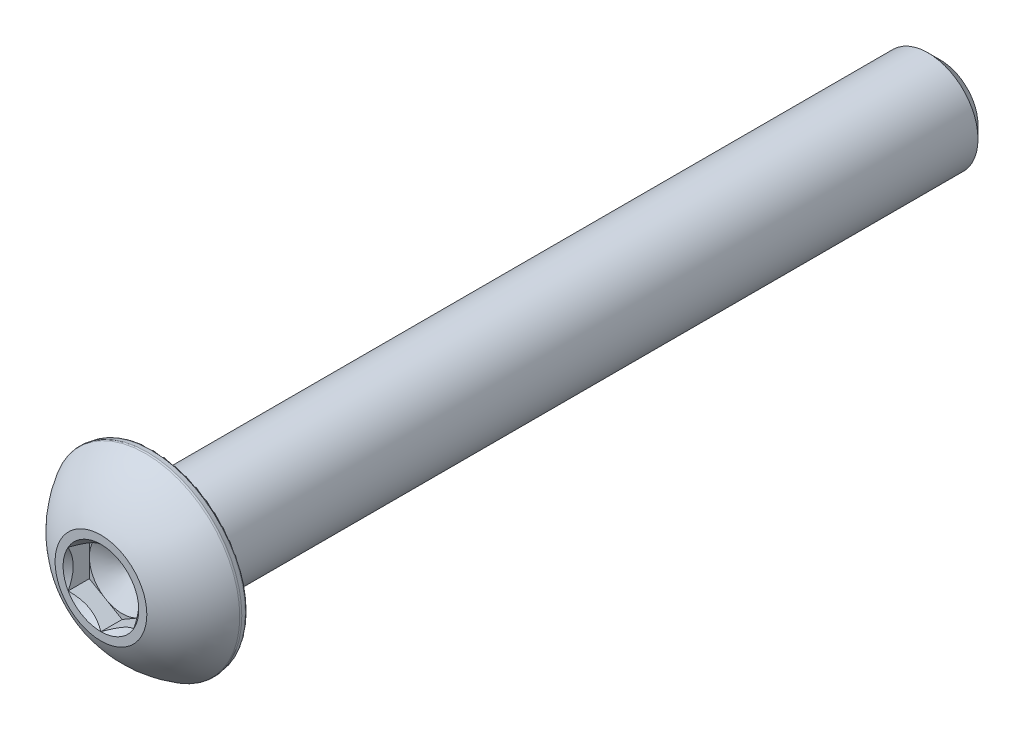
ISO-10303-21;
HEADER;
FILE_DESCRIPTION(('STEP AP214'),'2;1');
FILE_NAME('part.step','',(''),(''),'','','');
FILE_SCHEMA(('AUTOMOTIVE_DESIGN { 1 0 10303 214 1 1 1 1 }'));
ENDSEC;
DATA;
#1=APPLICATION_CONTEXT('core data for automotive mechanical design processes');
#2=APPLICATION_PROTOCOL_DEFINITION('international standard','automotive_design',2000,#1);
#3=PRODUCT_CONTEXT('',#1,'mechanical');
#4=PRODUCT('Part','Part','',(#3));
#5=PRODUCT_RELATED_PRODUCT_CATEGORY('part','',(#4));
#6=PRODUCT_DEFINITION_FORMATION('','',#4);
#7=PRODUCT_DEFINITION_CONTEXT('part definition',#1,'design');
#8=PRODUCT_DEFINITION('design','',#6,#7);
#9=PRODUCT_DEFINITION_SHAPE('','',#8);
#10=(LENGTH_UNIT() NAMED_UNIT(*) SI_UNIT(.MILLI.,.METRE.));
#11=(NAMED_UNIT(*) PLANE_ANGLE_UNIT() SI_UNIT($,.RADIAN.));
#12=(NAMED_UNIT(*) SI_UNIT($,.STERADIAN.) SOLID_ANGLE_UNIT());
#13=UNCERTAINTY_MEASURE_WITH_UNIT(LENGTH_MEASURE(1.E-05),#10,'distance_accuracy_value','');
#14=(GEOMETRIC_REPRESENTATION_CONTEXT(3) GLOBAL_UNCERTAINTY_ASSIGNED_CONTEXT((#13)) GLOBAL_UNIT_ASSIGNED_CONTEXT((#10,
#11,#12)) REPRESENTATION_CONTEXT('',''));
#15=CARTESIAN_POINT('',(0.,0.,0.));
#16=DIRECTION('',(0.,0.,1.));
#17=DIRECTION('',(1.,0.,0.));
#18=AXIS2_PLACEMENT_3D('',#15,#16,#17);
#19=CARTESIAN_POINT('',(0.,1.5875,20.3327));
#20=DIRECTION('',(0.,0.,-1.));
#21=DIRECTION('',(-1.,0.,0.));
#22=AXIS2_PLACEMENT_3D('',#19,#20,#21);
#23=PLANE('',#22);
#24=CARTESIAN_POINT('',(0.,0.,20.3327));
#25=DIRECTION('',(0.,0.,1.));
#26=DIRECTION('',(1.,0.,0.));
#27=AXIS2_PLACEMENT_3D('',#24,#25,#26);
#28=CIRCLE('',#27,2.2225);
#29=CARTESIAN_POINT('',(2.2225,0.,20.3327));
#30=VERTEX_POINT('',#29);
#31=EDGE_CURVE('E169',#30,#30,#28,.T.);
#32=ORIENTED_EDGE('',*,*,#31,.T.);
#33=EDGE_LOOP('',(#32));
#34=FACE_BOUND('',#33,.T.);
#35=CARTESIAN_POINT('',(0.,0.,20.3327));
#36=DIRECTION('',(0.,0.,1.));
#37=DIRECTION('',(1.,0.,0.));
#38=AXIS2_PLACEMENT_3D('',#35,#36,#37);
#39=CIRCLE('',#38,1.83308710467706);
#40=CARTESIAN_POINT('',(0.,1.83308710467706,20.3327));
#41=VERTEX_POINT('',#40);
#42=CARTESIAN_POINT('',(-1.5875,0.916543552338526,20.3327));
#43=VERTEX_POINT('',#42);
#44=EDGE_CURVE('E123',#41,#43,#39,.T.);
#45=ORIENTED_EDGE('',*,*,#44,.F.);
#46=CARTESIAN_POINT('',(0.,0.,20.3327));
#47=DIRECTION('',(0.,0.,1.));
#48=DIRECTION('',(1.,0.,0.));
#49=AXIS2_PLACEMENT_3D('',#46,#47,#48);
#50=CIRCLE('',#49,1.83308710467706);
#51=CARTESIAN_POINT('',(1.5875,0.916543552338528,20.3327));
#52=VERTEX_POINT('',#51);
#53=EDGE_CURVE('E108',#52,#41,#50,.T.);
#54=ORIENTED_EDGE('',*,*,#53,.F.);
#55=CARTESIAN_POINT('',(0.,0.,20.3327));
#56=DIRECTION('',(0.,0.,1.));
#57=DIRECTION('',(1.,0.,0.));
#58=AXIS2_PLACEMENT_3D('',#55,#56,#57);
#59=CIRCLE('',#58,1.83308710467706);
#60=CARTESIAN_POINT('',(1.5875,-0.916543552338527,20.3327));
#61=VERTEX_POINT('',#60);
#62=EDGE_CURVE('E119',#61,#52,#59,.T.);
#63=ORIENTED_EDGE('',*,*,#62,.F.);
#64=CARTESIAN_POINT('',(0.,0.,20.3327));
#65=DIRECTION('',(0.,0.,1.));
#66=DIRECTION('',(1.,0.,0.));
#67=AXIS2_PLACEMENT_3D('',#64,#65,#66);
#68=CIRCLE('',#67,1.83308710467706);
#69=CARTESIAN_POINT('',(0.,-1.83308710467706,20.3327));
#70=VERTEX_POINT('',#69);
#71=EDGE_CURVE('E140',#70,#61,#68,.T.);
#72=ORIENTED_EDGE('',*,*,#71,.F.);
#73=CARTESIAN_POINT('',(0.,0.,20.3327));
#74=DIRECTION('',(0.,0.,1.));
#75=DIRECTION('',(1.,0.,0.));
#76=AXIS2_PLACEMENT_3D('',#73,#74,#75);
#77=CIRCLE('',#76,1.83308710467706);
#78=CARTESIAN_POINT('',(-1.5875,-0.916543552338531,20.3327));
#79=VERTEX_POINT('',#78);
#80=EDGE_CURVE('E542',#79,#70,#77,.T.);
#81=ORIENTED_EDGE('',*,*,#80,.F.);
#82=CARTESIAN_POINT('',(0.,0.,20.3327));
#83=DIRECTION('',(0.,0.,1.));
#84=DIRECTION('',(1.,0.,0.));
#85=AXIS2_PLACEMENT_3D('',#82,#83,#84);
#86=CIRCLE('',#85,1.83308710467706);
#87=EDGE_CURVE('E285',#43,#79,#86,.T.);
#88=ORIENTED_EDGE('',*,*,#87,.F.);
#89=EDGE_LOOP('',(#45,#54,#63,#72,#81,#88));
#90=FACE_BOUND('',#89,.T.);
#91=ADVANCED_FACE('F35',(#34,#90),#23,.F.);
#92=CARTESIAN_POINT('',(0.,0.,-20.3327));
#93=DIRECTION('',(0.,0.,1.));
#94=DIRECTION('',(1.,0.,0.));
#95=AXIS2_PLACEMENT_3D('',#92,#93,#94);
#96=CONICAL_SURFACE('',#95,1.8176875,0.785398163397447);
#97=CARTESIAN_POINT('',(0.,0.,-19.7373875));
#98=DIRECTION('',(0.,0.,1.));
#99=DIRECTION('',(1.,0.,0.));
#100=AXIS2_PLACEMENT_3D('',#97,#98,#99);
#101=CIRCLE('',#100,2.413);
#102=CARTESIAN_POINT('',(2.413,0.,-19.7373875));
#103=VERTEX_POINT('',#102);
#104=EDGE_CURVE('E176',#103,#103,#101,.T.);
#105=ORIENTED_EDGE('',*,*,#104,.F.);
#106=EDGE_LOOP('',(#105));
#107=FACE_BOUND('',#106,.T.);
#108=CARTESIAN_POINT('',(0.,0.,-20.3327));
#109=DIRECTION('',(0.,0.,1.));
#110=DIRECTION('',(1.,0.,0.));
#111=AXIS2_PLACEMENT_3D('',#108,#109,#110);
#112=CIRCLE('',#111,1.8176875);
#113=CARTESIAN_POINT('',(1.8176875,0.,-20.3327));
#114=VERTEX_POINT('',#113);
#115=EDGE_CURVE('E162',#114,#114,#112,.T.);
#116=ORIENTED_EDGE('',*,*,#115,.T.);
#117=EDGE_LOOP('',(#116));
#118=FACE_BOUND('',#117,.T.);
#119=ADVANCED_FACE('F213',(#107,#118),#96,.T.);
#120=CARTESIAN_POINT('',(0.,0.,20.3327));
#121=DIRECTION('',(0.,0.,1.));
#122=DIRECTION('',(1.,0.,0.));
#123=AXIS2_PLACEMENT_3D('',#120,#121,#122);
#124=CYLINDRICAL_SURFACE('',#123,2.413);
#125=CARTESIAN_POINT('',(0.,0.,17.7673));
#126=DIRECTION('',(0.,0.,1.));
#127=DIRECTION('',(1.,0.,0.));
#128=AXIS2_PLACEMENT_3D('',#125,#126,#127);
#129=CIRCLE('',#128,2.413);
#130=CARTESIAN_POINT('',(2.413,0.,17.7673));
#131=VERTEX_POINT('',#130);
#132=EDGE_CURVE('E173',#131,#131,#129,.T.);
#133=ORIENTED_EDGE('',*,*,#132,.F.);
#134=EDGE_LOOP('',(#133));
#135=FACE_BOUND('',#134,.T.);
#136=ORIENTED_EDGE('',*,*,#104,.T.);
#137=EDGE_LOOP('',(#136));
#138=FACE_BOUND('',#137,.T.);
#139=ADVANCED_FACE('F218',(#135,#138),#124,.T.);
#140=CARTESIAN_POINT('',(0.,4.5207184955715,17.7673));
#141=DIRECTION('',(0.,0.,1.));
#142=DIRECTION('',(1.,0.,0.));
#143=AXIS2_PLACEMENT_3D('',#140,#141,#142);
#144=PLANE('',#143);
#145=CARTESIAN_POINT('',(0.,0.,17.7673));
#146=DIRECTION('',(0.,0.,1.));
#147=DIRECTION('',(1.,0.,0.));
#148=AXIS2_PLACEMENT_3D('',#145,#146,#147);
#149=CIRCLE('',#148,4.41308718588039);
#150=CARTESIAN_POINT('',(4.41308718588039,0.,17.7673));
#151=VERTEX_POINT('',#150);
#152=EDGE_CURVE('E43',#151,#151,#149,.F.);
#153=ORIENTED_EDGE('',*,*,#152,.T.);
#154=EDGE_LOOP('',(#153));
#155=FACE_BOUND('',#154,.T.);
#156=ORIENTED_EDGE('',*,*,#132,.T.);
#157=EDGE_LOOP('',(#156));
#158=FACE_BOUND('',#157,.T.);
#159=ADVANCED_FACE('F187',(#155,#158),#144,.F.);
#160=CARTESIAN_POINT('',(0.,0.,17.7673));
#161=DIRECTION('',(0.,0.,1.));
#162=DIRECTION('',(1.,0.,0.));
#163=AXIS2_PLACEMENT_3D('',#160,#161,#162);
#164=CONICAL_SURFACE('',#163,4.5207184955715,0.174532925199425);
#165=CARTESIAN_POINT('',(0.,0.,17.8732961482507));
#166=DIRECTION('',(0.,0.,-1.));
#167=DIRECTION('',(-1.,0.,0.));
#168=AXIS2_PLACEMENT_3D('',#165,#166,#167);
#169=CIRCLE('',#168,4.53940847635927);
#170=CARTESIAN_POINT('',(-4.53940847635927,0.,17.8732961482507));
#171=VERTEX_POINT('',#170);
#172=EDGE_CURVE('E182',#171,#171,#169,.F.);
#173=ORIENTED_EDGE('',*,*,#172,.T.);
#174=EDGE_LOOP('',(#173));
#175=FACE_BOUND('',#174,.T.);
#176=CARTESIAN_POINT('',(0.,0.,18.0850202312843));
#177=DIRECTION('',(0.,0.,-1.));
#178=DIRECTION('',(-1.,0.,0.));
#179=AXIS2_PLACEMENT_3D('',#176,#177,#178);
#180=CIRCLE('',#179,4.57674114466386);
#181=CARTESIAN_POINT('',(-4.57674114466386,0.,18.0850202312843));
#182=VERTEX_POINT('',#181);
#183=EDGE_CURVE('E179',#182,#182,#180,.T.);
#184=ORIENTED_EDGE('',*,*,#183,.T.);
#185=EDGE_LOOP('',(#184));
#186=FACE_BOUND('',#185,.T.);
#187=ADVANCED_FACE('F195',(#175,#186),#164,.T.);
#188=CARTESIAN_POINT('',(0.,0.,15.5811096257943));
#189=DIRECTION('',(0.,0.,1.));
#190=DIRECTION('',(0.,1.,0.));
#191=AXIS2_PLACEMENT_3D('',#188,#189,#190);
#192=SPHERICAL_SURFACE('',#191,5.24567606074225);
#193=CARTESIAN_POINT('',(0.,0.,18.1706139909096));
#194=DIRECTION('',(0.,0.,-1.));
#195=DIRECTION('',(-1.,0.,0.));
#196=AXIS2_PLACEMENT_3D('',#193,#194,#195);
#197=CIRCLE('',#196,4.56197155594959);
#198=CARTESIAN_POINT('',(-4.56197155594959,0.,18.1706139909096));
#199=VERTEX_POINT('',#198);
#200=EDGE_CURVE('E11',#199,#199,#197,.F.);
#201=ORIENTED_EDGE('',*,*,#200,.T.);
#202=EDGE_LOOP('',(#201));
#203=FACE_BOUND('',#202,.T.);
#204=ORIENTED_EDGE('',*,*,#31,.F.);
#205=EDGE_LOOP('',(#204));
#206=FACE_BOUND('',#205,.T.);
#207=ADVANCED_FACE('F198',(#203,#206),#192,.T.);
#208=CARTESIAN_POINT('',(0.,1.8176875,-20.3327));
#209=DIRECTION('',(0.,0.,1.));
#210=DIRECTION('',(1.,0.,0.));
#211=AXIS2_PLACEMENT_3D('',#208,#209,#210);
#212=PLANE('',#211);
#213=ORIENTED_EDGE('',*,*,#115,.F.);
#214=EDGE_LOOP('',(#213));
#215=FACE_BOUND('',#214,.T.);
#216=ADVANCED_FACE('F208',(#215),#212,.F.);
#217=CARTESIAN_POINT('',(1.5875,0.91654355233853,20.3327));
#218=DIRECTION('',(-0.499999999999999,-0.866025403784439,0.));
#219=DIRECTION('',(0.866025403784439,-0.499999999999999,0.));
#220=AXIS2_PLACEMENT_3D('',#217,#218,#219);
#221=PLANE('',#220);
#222=CARTESIAN_POINT('',(1.5877,0.916428082284693,20.3328154809637));
#223=CARTESIAN_POINT('',(1.53312479190086,0.947937093371809,20.3013308083706));
#224=CARTESIAN_POINT('',(1.47763696320971,0.979973006203394,20.2716950460135));
#225=CARTESIAN_POINT('',(1.36449087915364,1.04529792829092,20.2174322600208));
#226=CARTESIAN_POINT('',(1.30682185887062,1.07859315267522,20.1928354351332));
#227=CARTESIAN_POINT('',(1.1905349781269,1.14573141457583,20.1507003642726));
#228=CARTESIAN_POINT('',(1.13194674474407,1.17955734689075,20.1330561927298));
#229=CARTESIAN_POINT('',(1.01348022674557,1.24795402294714,20.105871470085));
#230=CARTESIAN_POINT('',(0.953605562983893,1.28252267618759,20.0963106206951));
#231=CARTESIAN_POINT('',(0.850418771876555,1.34209759781022,20.087684413104));
#232=CARTESIAN_POINT('',(0.807240015952285,1.36702686416637,20.0864071928096));
#233=CARTESIAN_POINT('',(0.720953038535396,1.41684467380557,20.0885570558147));
#234=CARTESIAN_POINT('',(0.677844847078609,1.44173319974742,20.0919857885493));
#235=CARTESIAN_POINT('',(0.592046335002028,1.49126899379091,20.1033509944333));
#236=CARTESIAN_POINT('',(0.549356408925404,1.51591603410293,20.1112913718016));
#237=CARTESIAN_POINT('',(0.464693063478356,1.56479643938728,20.1312484144511));
#238=CARTESIAN_POINT('',(0.422719959755072,1.58902962212064,20.1432668292087));
#239=CARTESIAN_POINT('',(0.315211458113564,1.65109968448354,20.1789468972472));
#240=CARTESIAN_POINT('',(0.250342771708898,1.68855163804125,20.2052985723031));
#241=CARTESIAN_POINT('',(0.154961599380923,1.74361998356043,20.2497835368517));
#242=CARTESIAN_POINT('',(0.123530699536155,1.76176662204668,20.2654128578011));
#243=CARTESIAN_POINT('',(0.0612469855696354,1.79772614107138,20.2980984878611));
#244=CARTESIAN_POINT('',(0.0303939039605747,1.8155391760437,20.315154115657));
#245=CARTESIAN_POINT('',(-0.000200000000001664,1.8332025747309,20.3328154809637));
#246=B_SPLINE_CURVE_WITH_KNOTS('',3,(#222,#223,#224,#225,#226,#227,#228,#229,#230,#231,#232,
#233,#234,#235,#236,#237,#238,#239,#240,#241,#242,#243,#244,#245),.UNSPECIFIED.,.F.,.F.,(4,2,2,
2,2,2,2,2,2,2,2,4),(0.,0.211482650810817,0.424197870807277,0.633533884524818,0.842342653263352,
0.991755553727145,1.14122083674205,1.29081565918878,1.44047473906438,1.6781878086972,
1.79671410024894,1.91518409436631),.UNSPECIFIED.);
#247=EDGE_CURVE('E105',#52,#41,#246,.T.);
#248=ORIENTED_EDGE('',*,*,#247,.T.);
#249=DIRECTION('',(0.,0.,-1.));
#250=VECTOR('',#249,1.);
#251=CARTESIAN_POINT('',(0.,1.83308710467706,20.3327));
#252=LINE('',#251,#250);
#253=CARTESIAN_POINT('',(0.,1.83308710467706,19.30654));
#254=VERTEX_POINT('',#253);
#255=EDGE_CURVE('E160',#41,#254,#252,.T.);
#256=ORIENTED_EDGE('',*,*,#255,.T.);
#257=DIRECTION('',(-0.866025403784439,0.499999999999999,0.));
#258=VECTOR('',#257,1.);
#259=CARTESIAN_POINT('',(1.5875,0.91654355233853,19.30654));
#260=LINE('',#259,#258);
#261=CARTESIAN_POINT('',(0.793749999999999,1.3748153285078,19.30654));
#262=VERTEX_POINT('',#261);
#263=EDGE_CURVE('E288',#262,#254,#260,.T.);
#264=ORIENTED_EDGE('',*,*,#263,.F.);
#265=CARTESIAN_POINT('',(1.5875,0.91654355233853,19.30654));
#266=VERTEX_POINT('',#265);
#267=EDGE_CURVE('E50',#266,#262,#260,.T.);
#268=ORIENTED_EDGE('',*,*,#267,.F.);
#269=DIRECTION('',(0.,0.,-1.));
#270=VECTOR('',#269,1.);
#271=CARTESIAN_POINT('',(1.5875,0.91654355233853,20.3327));
#272=LINE('',#271,#270);
#273=EDGE_CURVE('E136',#52,#266,#272,.T.);
#274=ORIENTED_EDGE('',*,*,#273,.F.);
#275=EDGE_LOOP('',(#248,#256,#264,#268,#274));
#276=FACE_BOUND('',#275,.T.);
#277=ADVANCED_FACE('F142',(#276),#221,.T.);
#278=CARTESIAN_POINT('',(0.,1.83308710467706,20.3327));
#279=DIRECTION('',(0.5,-0.866025403784438,0.));
#280=DIRECTION('',(0.866025403784438,0.5,0.));
#281=AXIS2_PLACEMENT_3D('',#278,#279,#280);
#282=PLANE('',#281);
#283=CARTESIAN_POINT('',(0.000199999999998742,1.8332025747309,20.3328154809637));
#284=CARTESIAN_POINT('',(-0.0543752080991369,1.80169356364378,20.3013308083706));
#285=CARTESIAN_POINT('',(-0.10986303679029,1.7696576508122,20.2716950460135));
#286=CARTESIAN_POINT('',(-0.223009120846359,1.70433272872467,20.2174322600208));
#287=CARTESIAN_POINT('',(-0.280678141129381,1.67103750434037,20.1928354351332));
#288=CARTESIAN_POINT('',(-0.396965021873104,1.60389924243976,20.1507003642726));
#289=CARTESIAN_POINT('',(-0.455553255255932,1.57007331012484,20.1330561927298));
#290=CARTESIAN_POINT('',(-0.574019773254432,1.50167663406845,20.105871470085));
#291=CARTESIAN_POINT('',(-0.633894437016106,1.46710798082801,20.0963106206951));
#292=CARTESIAN_POINT('',(-0.737081228123444,1.40753305920537,20.087684413104));
#293=CARTESIAN_POINT('',(-0.780259984047714,1.38260379284922,20.0864071928096));
#294=CARTESIAN_POINT('',(-0.866546961464603,1.33278598321002,20.0885570558147));
#295=CARTESIAN_POINT('',(-0.90965515292139,1.30789745726817,20.0919857885493));
#296=CARTESIAN_POINT('',(-0.995453664997971,1.25836166322468,20.1033509944333));
#297=CARTESIAN_POINT('',(-1.03814359107459,1.23371462291266,20.1112913718016));
#298=CARTESIAN_POINT('',(-1.12280693652164,1.18483421762831,20.1312484144511));
#299=CARTESIAN_POINT('',(-1.16478004024493,1.16060103489495,20.1432668292087));
#300=CARTESIAN_POINT('',(-1.27228854188644,1.09853097253205,20.1789468972472));
#301=CARTESIAN_POINT('',(-1.3371572282911,1.06107901897434,20.2052985723031));
#302=CARTESIAN_POINT('',(-1.43253840061908,1.00601067345516,20.2497835368517));
#303=CARTESIAN_POINT('',(-1.46396930046384,0.987864034968912,20.2654128578011));
#304=CARTESIAN_POINT('',(-1.52625301443036,0.951904515944212,20.2980984878611));
#305=CARTESIAN_POINT('',(-1.55710609603943,0.934091480971891,20.315154115657));
#306=CARTESIAN_POINT('',(-1.5877,0.91642808228469,20.3328154809637));
#307=B_SPLINE_CURVE_WITH_KNOTS('',3,(#283,#284,#285,#286,#287,#288,#289,#290,#291,#292,#293,
#294,#295,#296,#297,#298,#299,#300,#301,#302,#303,#304,#305,#306),.UNSPECIFIED.,.F.,.F.,(4,2,2,
2,2,2,2,2,2,2,2,4),(0.,0.211482650810816,0.424197870807276,0.633533884524816,0.842342653263349,
0.991755553727142,1.14122083674205,1.29081565918877,1.44047473906438,1.6781878086972,
1.79671410024894,1.91518409436631),.UNSPECIFIED.);
#308=EDGE_CURVE('E276',#41,#43,#307,.T.);
#309=ORIENTED_EDGE('',*,*,#308,.T.);
#310=DIRECTION('',(0.,0.,-1.));
#311=VECTOR('',#310,1.);
#312=CARTESIAN_POINT('',(-1.5875,0.916543552338529,20.3327));
#313=LINE('',#312,#311);
#314=CARTESIAN_POINT('',(-1.5875,0.916543552338529,19.30654));
#315=VERTEX_POINT('',#314);
#316=EDGE_CURVE('E157',#43,#315,#313,.T.);
#317=ORIENTED_EDGE('',*,*,#316,.T.);
#318=DIRECTION('',(-0.866025403784438,-0.5,0.));
#319=VECTOR('',#318,1.);
#320=CARTESIAN_POINT('',(0.,1.83308710467706,19.30654));
#321=LINE('',#320,#319);
#322=CARTESIAN_POINT('',(-0.793750000000001,1.3748153285078,19.30654));
#323=VERTEX_POINT('',#322);
#324=EDGE_CURVE('E290',#323,#315,#321,.T.);
#325=ORIENTED_EDGE('',*,*,#324,.F.);
#326=EDGE_CURVE('E291',#254,#323,#321,.T.);
#327=ORIENTED_EDGE('',*,*,#326,.F.);
#328=ORIENTED_EDGE('',*,*,#255,.F.);
#329=EDGE_LOOP('',(#309,#317,#325,#327,#328));
#330=FACE_BOUND('',#329,.T.);
#331=ADVANCED_FACE('F241',(#330),#282,.T.);
#332=CARTESIAN_POINT('',(-1.5875,0.916543552338529,20.3327));
#333=DIRECTION('',(1.,0.,0.));
#334=DIRECTION('',(0.,1.,0.));
#335=AXIS2_PLACEMENT_3D('',#332,#333,#334);
#336=PLANE('',#335);
#337=CARTESIAN_POINT('',(-1.5875,-1.80645042689209,20.904486986584));
#338=CARTESIAN_POINT('',(-1.5875,-1.76236619947004,20.8713776518921));
#339=CARTESIAN_POINT('',(-1.5875,-1.71803401722459,20.8385993672874));
#340=CARTESIAN_POINT('',(-1.5875,-1.62877387436181,20.7738409272978));
#341=CARTESIAN_POINT('',(-1.5875,-1.58384576476286,20.7418609774832));
#342=CARTESIAN_POINT('',(-1.5875,-1.44736053267712,20.6468669615479));
#343=CARTESIAN_POINT('',(-1.5875,-1.3547728804759,20.5853088242448));
#344=CARTESIAN_POINT('',(-1.5875,-1.16075761948671,20.4646575197201));
#345=CARTESIAN_POINT('',(-1.5875,-1.05912459725147,20.405890844098));
#346=CARTESIAN_POINT('',(-1.5875,-0.850810108093354,20.2985306781203));
#347=CARTESIAN_POINT('',(-1.5875,-0.744147188151382,20.2499029254242));
#348=CARTESIAN_POINT('',(-1.5875,-0.583837187923044,20.1904180795062));
#349=CARTESIAN_POINT('',(-1.5875,-0.532518160842358,20.1733101147626));
#350=CARTESIAN_POINT('',(-1.5875,-0.428659985513866,20.1432170530757));
#351=CARTESIAN_POINT('',(-1.5875,-0.37612075167657,20.1302322462879));
#352=CARTESIAN_POINT('',(-1.5875,-0.271003698108568,20.1092703974627));
#353=CARTESIAN_POINT('',(-1.5875,-0.218442994151922,20.1012088512206));
#354=CARTESIAN_POINT('',(-1.5875,-0.112783135871372,20.0902474681039));
#355=CARTESIAN_POINT('',(-1.5875,-0.0596840710482694,20.0873467869566));
#356=CARTESIAN_POINT('',(-1.5875,0.0447055832560302,20.0869138193186));
#357=CARTESIAN_POINT('',(-1.5875,0.0959954901561857,20.0892001279368));
#358=CARTESIAN_POINT('',(-1.5875,0.19812518570528,20.0986197058015));
#359=CARTESIAN_POINT('',(-1.5875,0.248964929488491,20.1057534527826));
#360=CARTESIAN_POINT('',(-1.5875,0.350686556652122,20.1246031096994));
#361=CARTESIAN_POINT('',(-1.5875,0.401553911407876,20.136396261495));
#362=CARTESIAN_POINT('',(-1.5875,0.50217981053946,20.1639444375564));
#363=CARTESIAN_POINT('',(-1.5875,0.551938454553039,20.1796991042322));
#364=CARTESIAN_POINT('',(-1.5875,0.709597941546692,20.2355173760564));
#365=CARTESIAN_POINT('',(-1.5875,0.815228306930167,20.2819791563384));
#366=CARTESIAN_POINT('',(-1.5875,1.02151735170486,20.3852514550853));
#367=CARTESIAN_POINT('',(-1.5875,1.12215634479547,20.4420993580816));
#368=CARTESIAN_POINT('',(-1.5875,1.31447644029508,20.5593491247074));
#369=CARTESIAN_POINT('',(-1.5875,1.40635401847359,20.6194326845134));
#370=CARTESIAN_POINT('',(-1.5875,1.54171769329396,20.7123019080447));
#371=CARTESIAN_POINT('',(-1.5875,1.58625419266993,20.7435831278697));
#372=CARTESIAN_POINT('',(-1.5875,1.67471932537719,20.8069692036077));
#373=CARTESIAN_POINT('',(-1.5875,1.71864812234279,20.8390738308869));
#374=CARTESIAN_POINT('',(-1.5875,1.76232404534813,20.8715197844761));
#375=B_SPLINE_CURVE_WITH_KNOTS('',3,(#337,#338,#339,#340,#341,#342,#343,#344,#345,#346,#347,
#348,#349,#350,#351,#352,#353,#354,#355,#356,#357,#358,#359,#360,#361,#362,#363,#364,#365,#366,
#367,#368,#369,#370,#371,#372,#373,#374),.UNSPECIFIED.,.F.,.F.,(4,2,2,2,2,2,2,2,2,2,2,2,2,2,2,2,
2,2,4),(0.,0.165394720611768,0.330831599805599,0.664230904656281,1.01613642769876,
1.3668327644345,1.5289815746679,1.69114179313302,1.85043410106594,2.00970034776346,
2.16348276168556,2.31728033368487,2.47374234648082,2.63019024115107,2.97536284656898,
3.32180328575216,3.65097853196649,3.8142455159316,3.97746764647571),.UNSPECIFIED.);
#376=EDGE_CURVE('E284',#43,#79,#375,.F.);
#377=ORIENTED_EDGE('',*,*,#376,.T.);
#378=DIRECTION('',(0.,0.,-1.));
#379=VECTOR('',#378,1.);
#380=CARTESIAN_POINT('',(-1.5875,-0.91654355233853,20.3327));
#381=LINE('',#380,#379);
#382=CARTESIAN_POINT('',(-1.5875,-0.91654355233853,19.30654));
#383=VERTEX_POINT('',#382);
#384=EDGE_CURVE('E154',#79,#383,#381,.T.);
#385=ORIENTED_EDGE('',*,*,#384,.T.);
#386=DIRECTION('',(0.,-1.,0.));
#387=VECTOR('',#386,1.);
#388=CARTESIAN_POINT('',(-1.5875,0.916543552338529,19.30654));
#389=LINE('',#388,#387);
#390=CARTESIAN_POINT('',(-1.5875,0.,19.30654));
#391=VERTEX_POINT('',#390);
#392=EDGE_CURVE('E294',#391,#383,#389,.T.);
#393=ORIENTED_EDGE('',*,*,#392,.F.);
#394=EDGE_CURVE('E295',#315,#391,#389,.T.);
#395=ORIENTED_EDGE('',*,*,#394,.F.);
#396=ORIENTED_EDGE('',*,*,#316,.F.);
#397=EDGE_LOOP('',(#377,#385,#393,#395,#396));
#398=FACE_BOUND('',#397,.T.);
#399=ADVANCED_FACE('F246',(#398),#336,.T.);
#400=CARTESIAN_POINT('',(-1.5875,-0.91654355233853,20.3327));
#401=DIRECTION('',(0.5,0.866025403784439,0.));
#402=DIRECTION('',(-0.866025403784439,0.5,0.));
#403=AXIS2_PLACEMENT_3D('',#400,#401,#402);
#404=PLANE('',#403);
#405=CARTESIAN_POINT('',(-1.5877,-0.916428082284692,20.3328154809637));
#406=CARTESIAN_POINT('',(-1.53312479190087,-0.947937093371808,20.3013308083706));
#407=CARTESIAN_POINT('',(-1.47763696320971,-0.979973006203393,20.2716950460135));
#408=CARTESIAN_POINT('',(-1.36449087915364,-1.04529792829092,20.2174322600208));
#409=CARTESIAN_POINT('',(-1.30682185887062,-1.07859315267522,20.1928354351332));
#410=CARTESIAN_POINT('',(-1.1905349781269,-1.14573141457583,20.1507003642726));
#411=CARTESIAN_POINT('',(-1.13194674474407,-1.17955734689075,20.1330561927298));
#412=CARTESIAN_POINT('',(-1.01348022674557,-1.24795402294714,20.105871470085));
#413=CARTESIAN_POINT('',(-0.953605562983894,-1.28252267618759,20.0963106206951));
#414=CARTESIAN_POINT('',(-0.850418771876556,-1.34209759781022,20.087684413104));
#415=CARTESIAN_POINT('',(-0.807240015952286,-1.36702686416637,20.0864071928096));
#416=CARTESIAN_POINT('',(-0.720953038535397,-1.41684467380557,20.0885570558147));
#417=CARTESIAN_POINT('',(-0.67784484707861,-1.44173319974742,20.0919857885493));
#418=CARTESIAN_POINT('',(-0.592046335002029,-1.49126899379091,20.1033509944333));
#419=CARTESIAN_POINT('',(-0.549356408925405,-1.51591603410293,20.1112913718016));
#420=CARTESIAN_POINT('',(-0.464693063478358,-1.56479643938728,20.1312484144511));
#421=CARTESIAN_POINT('',(-0.422719959755073,-1.58902962212064,20.1432668292087));
#422=CARTESIAN_POINT('',(-0.315211458113565,-1.65109968448354,20.1789468972472));
#423=CARTESIAN_POINT('',(-0.2503427717089,-1.68855163804125,20.2052985723031));
#424=CARTESIAN_POINT('',(-0.154961599380925,-1.74361998356043,20.2497835368517));
#425=CARTESIAN_POINT('',(-0.123530699536157,-1.76176662204668,20.2654128578011));
#426=CARTESIAN_POINT('',(-0.061246985569637,-1.79772614107138,20.2980984878611));
#427=CARTESIAN_POINT('',(-0.0303939039605762,-1.8155391760437,20.315154115657));
#428=CARTESIAN_POINT('',(0.000200000000000443,-1.8332025747309,20.3328154809637));
#429=B_SPLINE_CURVE_WITH_KNOTS('',3,(#405,#406,#407,#408,#409,#410,#411,#412,#413,#414,#415,
#416,#417,#418,#419,#420,#421,#422,#423,#424,#425,#426,#427,#428),.UNSPECIFIED.,.F.,.F.,(4,2,2,
2,2,2,2,2,2,2,2,4),(0.,0.211482650810817,0.424197870807277,0.633533884524819,0.842342653263352,
0.991755553727145,1.14122083674205,1.29081565918878,1.44047473906438,1.6781878086972,
1.79671410024894,1.91518409436631),.UNSPECIFIED.);
#430=EDGE_CURVE('E544',#79,#70,#429,.T.);
#431=ORIENTED_EDGE('',*,*,#430,.T.);
#432=DIRECTION('',(0.,0.,-1.));
#433=VECTOR('',#432,1.);
#434=CARTESIAN_POINT('',(0.,-1.83308710467706,20.3327));
#435=LINE('',#434,#433);
#436=CARTESIAN_POINT('',(0.,-1.83308710467706,19.30654));
#437=VERTEX_POINT('',#436);
#438=EDGE_CURVE('E145',#70,#437,#435,.T.);
#439=ORIENTED_EDGE('',*,*,#438,.T.);
#440=DIRECTION('',(0.866025403784439,-0.5,0.));
#441=VECTOR('',#440,1.);
#442=CARTESIAN_POINT('',(-1.5875,-0.91654355233853,19.30654));
#443=LINE('',#442,#441);
#444=CARTESIAN_POINT('',(-0.793749999999999,-1.3748153285078,19.30654));
#445=VERTEX_POINT('',#444);
#446=EDGE_CURVE('E298',#445,#437,#443,.T.);
#447=ORIENTED_EDGE('',*,*,#446,.F.);
#448=EDGE_CURVE('E299',#383,#445,#443,.T.);
#449=ORIENTED_EDGE('',*,*,#448,.F.);
#450=ORIENTED_EDGE('',*,*,#384,.F.);
#451=EDGE_LOOP('',(#431,#439,#447,#449,#450));
#452=FACE_BOUND('',#451,.T.);
#453=ADVANCED_FACE('F250',(#452),#404,.T.);
#454=CARTESIAN_POINT('',(0.,-1.83308710467706,20.3327));
#455=DIRECTION('',(-0.500000000000001,0.866025403784438,0.));
#456=DIRECTION('',(-0.866025403784438,-0.500000000000001,0.));
#457=AXIS2_PLACEMENT_3D('',#454,#455,#456);
#458=PLANE('',#457);
#459=CARTESIAN_POINT('',(-0.000199999999999405,-1.8332025747309,20.3328154809637));
#460=CARTESIAN_POINT('',(0.0543752080991366,-1.80169356364378,20.3013308083706));
#461=CARTESIAN_POINT('',(0.10986303679029,-1.7696576508122,20.2716950460135));
#462=CARTESIAN_POINT('',(0.223009120846359,-1.70433272872467,20.2174322600208));
#463=CARTESIAN_POINT('',(0.280678141129382,-1.67103750434037,20.1928354351332));
#464=CARTESIAN_POINT('',(0.396965021873105,-1.60389924243976,20.1507003642726));
#465=CARTESIAN_POINT('',(0.455553255255933,-1.57007331012484,20.1330561927298));
#466=CARTESIAN_POINT('',(0.574019773254433,-1.50167663406845,20.105871470085));
#467=CARTESIAN_POINT('',(0.633894437016107,-1.46710798082801,20.0963106206951));
#468=CARTESIAN_POINT('',(0.737081228123445,-1.40753305920537,20.087684413104));
#469=CARTESIAN_POINT('',(0.780259984047715,-1.38260379284922,20.0864071928096));
#470=CARTESIAN_POINT('',(0.866546961464604,-1.33278598321002,20.0885570558147));
#471=CARTESIAN_POINT('',(0.909655152921391,-1.30789745726817,20.0919857885493));
#472=CARTESIAN_POINT('',(0.995453664997972,-1.25836166322468,20.1033509944333));
#473=CARTESIAN_POINT('',(1.0381435910746,-1.23371462291266,20.1112913718016));
#474=CARTESIAN_POINT('',(1.12280693652164,-1.18483421762831,20.1312484144511));
#475=CARTESIAN_POINT('',(1.16478004024493,-1.16060103489495,20.1432668292087));
#476=CARTESIAN_POINT('',(1.27228854188644,-1.09853097253205,20.1789468972472));
#477=CARTESIAN_POINT('',(1.3371572282911,-1.06107901897434,20.2052985723031));
#478=CARTESIAN_POINT('',(1.43253840061908,-1.00601067345516,20.2497835368517));
#479=CARTESIAN_POINT('',(1.46396930046384,-0.987864034968912,20.2654128578011));
#480=CARTESIAN_POINT('',(1.52625301443036,-0.951904515944212,20.2980984878611));
#481=CARTESIAN_POINT('',(1.55710609603942,-0.934091480971892,20.315154115657));
#482=CARTESIAN_POINT('',(1.5877,-0.916428082284692,20.3328154809637));
#483=B_SPLINE_CURVE_WITH_KNOTS('',3,(#459,#460,#461,#462,#463,#464,#465,#466,#467,#468,#469,
#470,#471,#472,#473,#474,#475,#476,#477,#478,#479,#480,#481,#482),.UNSPECIFIED.,.F.,.F.,(4,2,2,
2,2,2,2,2,2,2,2,4),(0.,0.211482650810817,0.424197870807277,0.633533884524818,0.842342653263351,
0.991755553727144,1.14122083674205,1.29081565918878,1.44047473906438,1.6781878086972,
1.79671410024894,1.91518409436631),.UNSPECIFIED.);
#484=EDGE_CURVE('E311',#70,#61,#483,.T.);
#485=ORIENTED_EDGE('',*,*,#484,.T.);
#486=DIRECTION('',(0.,0.,-1.));
#487=VECTOR('',#486,1.);
#488=CARTESIAN_POINT('',(1.5875,-0.916543552338529,20.3327));
#489=LINE('',#488,#487);
#490=CARTESIAN_POINT('',(1.5875,-0.916543552338529,19.30654));
#491=VERTEX_POINT('',#490);
#492=EDGE_CURVE('E139',#61,#491,#489,.T.);
#493=ORIENTED_EDGE('',*,*,#492,.T.);
#494=DIRECTION('',(0.866025403784438,0.500000000000001,0.));
#495=VECTOR('',#494,1.);
#496=CARTESIAN_POINT('',(0.,-1.83308710467706,19.30654));
#497=LINE('',#496,#495);
#498=CARTESIAN_POINT('',(0.793750000000001,-1.3748153285078,19.30654));
#499=VERTEX_POINT('',#498);
#500=EDGE_CURVE('E301',#499,#491,#497,.T.);
#501=ORIENTED_EDGE('',*,*,#500,.F.);
#502=EDGE_CURVE('E302',#437,#499,#497,.T.);
#503=ORIENTED_EDGE('',*,*,#502,.F.);
#504=ORIENTED_EDGE('',*,*,#438,.F.);
#505=EDGE_LOOP('',(#485,#493,#501,#503,#504));
#506=FACE_BOUND('',#505,.T.);
#507=ADVANCED_FACE('F254',(#506),#458,.T.);
#508=CARTESIAN_POINT('',(1.5875,-0.916543552338529,20.3327));
#509=DIRECTION('',(-1.,0.,0.));
#510=DIRECTION('',(0.,-1.,0.));
#511=AXIS2_PLACEMENT_3D('',#508,#509,#510);
#512=PLANE('',#511);
#513=CARTESIAN_POINT('',(1.5875,-1.8064504268921,20.904486986584));
#514=CARTESIAN_POINT('',(1.5875,-1.76236619947005,20.8713776518921));
#515=CARTESIAN_POINT('',(1.5875,-1.71803401722459,20.8385993672874));
#516=CARTESIAN_POINT('',(1.5875,-1.62877387436181,20.7738409272978));
#517=CARTESIAN_POINT('',(1.5875,-1.58384576476286,20.7418609774832));
#518=CARTESIAN_POINT('',(1.5875,-1.44736053267712,20.6468669615479));
#519=CARTESIAN_POINT('',(1.5875,-1.3547728804759,20.5853088242448));
#520=CARTESIAN_POINT('',(1.5875,-1.16075761948671,20.4646575197201));
#521=CARTESIAN_POINT('',(1.5875,-1.05912459725147,20.405890844098));
#522=CARTESIAN_POINT('',(1.5875,-0.850810108093354,20.2985306781203));
#523=CARTESIAN_POINT('',(1.5875,-0.744147188151381,20.2499029254242));
#524=CARTESIAN_POINT('',(1.5875,-0.583837187923043,20.1904180795062));
#525=CARTESIAN_POINT('',(1.5875,-0.532518160842356,20.1733101147626));
#526=CARTESIAN_POINT('',(1.5875,-0.428659985513865,20.1432170530757));
#527=CARTESIAN_POINT('',(1.5875,-0.376120751676568,20.1302322462879));
#528=CARTESIAN_POINT('',(1.5875,-0.271003698108566,20.1092703974627));
#529=CARTESIAN_POINT('',(1.5875,-0.21844299415192,20.1012088512206));
#530=CARTESIAN_POINT('',(1.5875,-0.112783135871371,20.0902474681039));
#531=CARTESIAN_POINT('',(1.5875,-0.0596840710482687,20.0873467869566));
#532=CARTESIAN_POINT('',(1.5875,0.0447055832560304,20.0869138193186));
#533=CARTESIAN_POINT('',(1.5875,0.0959954901561859,20.0892001279368));
#534=CARTESIAN_POINT('',(1.5875,0.19812518570528,20.0986197058015));
#535=CARTESIAN_POINT('',(1.5875,0.248964929488492,20.1057534527826));
#536=CARTESIAN_POINT('',(1.5875,0.350686556652123,20.1246031096994));
#537=CARTESIAN_POINT('',(1.5875,0.401553911407878,20.136396261495));
#538=CARTESIAN_POINT('',(1.5875,0.502179810539461,20.1639444375564));
#539=CARTESIAN_POINT('',(1.5875,0.55193845455304,20.1796991042322));
#540=CARTESIAN_POINT('',(1.5875,0.709597941546693,20.2355173760564));
#541=CARTESIAN_POINT('',(1.5875,0.815228306930168,20.2819791563384));
#542=CARTESIAN_POINT('',(1.5875,1.02151735170486,20.3852514550853));
#543=CARTESIAN_POINT('',(1.5875,1.12215634479547,20.4420993580816));
#544=CARTESIAN_POINT('',(1.5875,1.31447644029508,20.5593491247074));
#545=CARTESIAN_POINT('',(1.5875,1.40635401847359,20.6194326845134));
#546=CARTESIAN_POINT('',(1.5875,1.54171769329396,20.7123019080447));
#547=CARTESIAN_POINT('',(1.5875,1.58625419266993,20.7435831278697));
#548=CARTESIAN_POINT('',(1.5875,1.67471932537719,20.8069692036077));
#549=CARTESIAN_POINT('',(1.5875,1.71864812234279,20.8390738308869));
#550=CARTESIAN_POINT('',(1.5875,1.76232404534814,20.8715197844761));
#551=B_SPLINE_CURVE_WITH_KNOTS('',3,(#513,#514,#515,#516,#517,#518,#519,#520,#521,#522,#523,
#524,#525,#526,#527,#528,#529,#530,#531,#532,#533,#534,#535,#536,#537,#538,#539,#540,#541,#542,
#543,#544,#545,#546,#547,#548,#549,#550),.UNSPECIFIED.,.F.,.F.,(4,2,2,2,2,2,2,2,2,2,2,2,2,2,2,2,
2,2,4),(0.,0.165394720611769,0.330831599805597,0.664230904656281,1.01613642769877,
1.36683276443451,1.5289815746679,1.69114179313303,1.85043410106594,2.00970034776346,
2.16348276168556,2.31728033368487,2.47374234648083,2.63019024115108,2.97536284656899,
3.32180328575217,3.65097853196649,3.8142455159316,3.97746764647571),.UNSPECIFIED.);
#552=EDGE_CURVE('E129',#61,#52,#551,.T.);
#553=ORIENTED_EDGE('',*,*,#552,.T.);
#554=ORIENTED_EDGE('',*,*,#273,.T.);
#555=DIRECTION('',(0.,1.,0.));
#556=VECTOR('',#555,1.);
#557=CARTESIAN_POINT('',(1.5875,-0.916543552338529,19.30654));
#558=LINE('',#557,#556);
#559=CARTESIAN_POINT('',(1.5875,0.,19.30654));
#560=VERTEX_POINT('',#559);
#561=EDGE_CURVE('E148',#560,#266,#558,.T.);
#562=ORIENTED_EDGE('',*,*,#561,.F.);
#563=EDGE_CURVE('E143',#491,#560,#558,.T.);
#564=ORIENTED_EDGE('',*,*,#563,.F.);
#565=ORIENTED_EDGE('',*,*,#492,.F.);
#566=EDGE_LOOP('',(#553,#554,#562,#564,#565));
#567=FACE_BOUND('',#566,.T.);
#568=ADVANCED_FACE('F134',(#567),#512,.T.);
#569=CARTESIAN_POINT('',(0.,0.,19.30654));
#570=DIRECTION('',(0.,0.,1.));
#571=DIRECTION('',(1.,0.,0.));
#572=AXIS2_PLACEMENT_3D('',#569,#570,#571);
#573=PLANE('',#572);
#574=CARTESIAN_POINT('',(0.,0.,19.30654));
#575=DIRECTION('',(0.,0.,1.));
#576=DIRECTION('',(1.,0.,0.));
#577=AXIS2_PLACEMENT_3D('',#574,#575,#576);
#578=CIRCLE('',#577,1.5875);
#579=EDGE_CURVE('E165',#499,#560,#578,.T.);
#580=ORIENTED_EDGE('',*,*,#579,.F.);
#581=ORIENTED_EDGE('',*,*,#500,.T.);
#582=ORIENTED_EDGE('',*,*,#563,.T.);
#583=EDGE_LOOP('',(#580,#581,#582));
#584=FACE_BOUND('',#583,.T.);
#585=ADVANCED_FACE('F261',(#584),#573,.T.);
#586=EDGE_CURVE('E317',#445,#499,#578,.T.);
#587=ORIENTED_EDGE('',*,*,#586,.F.);
#588=ORIENTED_EDGE('',*,*,#446,.T.);
#589=ORIENTED_EDGE('',*,*,#502,.T.);
#590=EDGE_LOOP('',(#587,#588,#589));
#591=FACE_BOUND('',#590,.T.);
#592=ADVANCED_FACE('F264',(#591),#573,.T.);
#593=EDGE_CURVE('E318',#391,#445,#578,.T.);
#594=ORIENTED_EDGE('',*,*,#593,.F.);
#595=ORIENTED_EDGE('',*,*,#392,.T.);
#596=ORIENTED_EDGE('',*,*,#448,.T.);
#597=EDGE_LOOP('',(#594,#595,#596));
#598=FACE_BOUND('',#597,.T.);
#599=ADVANCED_FACE('F333',(#598),#573,.T.);
#600=EDGE_CURVE('E319',#323,#391,#578,.T.);
#601=ORIENTED_EDGE('',*,*,#600,.F.);
#602=ORIENTED_EDGE('',*,*,#324,.T.);
#603=ORIENTED_EDGE('',*,*,#394,.T.);
#604=EDGE_LOOP('',(#601,#602,#603));
#605=FACE_BOUND('',#604,.T.);
#606=ADVANCED_FACE('F322',(#605),#573,.T.);
#607=EDGE_CURVE('E170',#262,#323,#578,.T.);
#608=ORIENTED_EDGE('',*,*,#607,.F.);
#609=ORIENTED_EDGE('',*,*,#263,.T.);
#610=ORIENTED_EDGE('',*,*,#326,.T.);
#611=EDGE_LOOP('',(#608,#609,#610));
#612=FACE_BOUND('',#611,.T.);
#613=ADVANCED_FACE('F327',(#612),#573,.T.);
#614=EDGE_CURVE('E166',#560,#262,#578,.T.);
#615=ORIENTED_EDGE('',*,*,#614,.F.);
#616=ORIENTED_EDGE('',*,*,#561,.T.);
#617=ORIENTED_EDGE('',*,*,#267,.T.);
#618=EDGE_LOOP('',(#615,#616,#617));
#619=FACE_BOUND('',#618,.T.);
#620=ADVANCED_FACE('F266',(#619),#573,.T.);
#621=CARTESIAN_POINT('',(0.,0.,19.30654));
#622=DIRECTION('',(0.,0.,1.));
#623=DIRECTION('',(1.,0.,0.));
#624=AXIS2_PLACEMENT_3D('',#621,#622,#623);
#625=CONICAL_SURFACE('',#624,1.5875,1.0471975511966);
#626=CARTESIAN_POINT('',(0.,0.,18.3899964476615));
#627=VERTEX_POINT('',#626);
#628=VERTEX_LOOP('',#627);
#629=FACE_BOUND('',#628,.T.);
#630=ORIENTED_EDGE('',*,*,#614,.T.);
#631=ORIENTED_EDGE('',*,*,#607,.T.);
#632=ORIENTED_EDGE('',*,*,#600,.T.);
#633=ORIENTED_EDGE('',*,*,#593,.T.);
#634=ORIENTED_EDGE('',*,*,#586,.T.);
#635=ORIENTED_EDGE('',*,*,#579,.T.);
#636=EDGE_LOOP('',(#630,#631,#632,#633,#634,#635));
#637=FACE_BOUND('',#636,.T.);
#638=ADVANCED_FACE('F222',(#629,#637),#625,.F.);
#639=CARTESIAN_POINT('',(0.,0.,20.3327));
#640=DIRECTION('',(0.,0.,1.));
#641=DIRECTION('',(1.,0.,0.));
#642=AXIS2_PLACEMENT_3D('',#639,#640,#641);
#643=CONICAL_SURFACE('',#642,1.83308710467706,0.78539816339745);
#644=ORIENTED_EDGE('',*,*,#44,.T.);
#645=ORIENTED_EDGE('',*,*,#308,.F.);
#646=EDGE_LOOP('',(#644,#645));
#647=FACE_BOUND('',#646,.T.);
#648=ADVANCED_FACE('F267',(#647),#643,.F.);
#649=CARTESIAN_POINT('',(0.,0.,20.3327));
#650=DIRECTION('',(0.,0.,1.));
#651=DIRECTION('',(1.,0.,0.));
#652=AXIS2_PLACEMENT_3D('',#649,#650,#651);
#653=CONICAL_SURFACE('',#652,1.83308710467706,0.78539816339745);
#654=ORIENTED_EDGE('',*,*,#87,.T.);
#655=ORIENTED_EDGE('',*,*,#376,.F.);
#656=EDGE_LOOP('',(#654,#655));
#657=FACE_BOUND('',#656,.T.);
#658=ADVANCED_FACE('F271',(#657),#653,.F.);
#659=CARTESIAN_POINT('',(0.,0.,20.3327));
#660=DIRECTION('',(0.,0.,1.));
#661=DIRECTION('',(1.,0.,0.));
#662=AXIS2_PLACEMENT_3D('',#659,#660,#661);
#663=CONICAL_SURFACE('',#662,1.83308710467706,0.78539816339745);
#664=ORIENTED_EDGE('',*,*,#80,.T.);
#665=ORIENTED_EDGE('',*,*,#430,.F.);
#666=EDGE_LOOP('',(#664,#665));
#667=FACE_BOUND('',#666,.T.);
#668=ADVANCED_FACE('F365',(#667),#663,.F.);
#669=CARTESIAN_POINT('',(0.,0.,20.3327));
#670=DIRECTION('',(0.,0.,1.));
#671=DIRECTION('',(1.,0.,0.));
#672=AXIS2_PLACEMENT_3D('',#669,#670,#671);
#673=CONICAL_SURFACE('',#672,1.83308710467706,0.78539816339745);
#674=ORIENTED_EDGE('',*,*,#71,.T.);
#675=ORIENTED_EDGE('',*,*,#484,.F.);
#676=EDGE_LOOP('',(#674,#675));
#677=FACE_BOUND('',#676,.T.);
#678=ADVANCED_FACE('F372',(#677),#673,.F.);
#679=CARTESIAN_POINT('',(0.,0.,20.3327));
#680=DIRECTION('',(0.,0.,1.));
#681=DIRECTION('',(1.,0.,0.));
#682=AXIS2_PLACEMENT_3D('',#679,#680,#681);
#683=CONICAL_SURFACE('',#682,1.83308710467706,0.78539816339745);
#684=ORIENTED_EDGE('',*,*,#62,.T.);
#685=ORIENTED_EDGE('',*,*,#552,.F.);
#686=EDGE_LOOP('',(#684,#685));
#687=FACE_BOUND('',#686,.T.);
#688=ADVANCED_FACE('F128',(#687),#683,.F.);
#689=CARTESIAN_POINT('',(0.,0.,20.3327));
#690=DIRECTION('',(0.,0.,1.));
#691=DIRECTION('',(1.,0.,0.));
#692=AXIS2_PLACEMENT_3D('',#689,#690,#691);
#693=CONICAL_SURFACE('',#692,1.83308710467706,0.78539816339745);
#694=ORIENTED_EDGE('',*,*,#53,.T.);
#695=ORIENTED_EDGE('',*,*,#247,.F.);
#696=EDGE_LOOP('',(#694,#695));
#697=FACE_BOUND('',#696,.T.);
#698=ADVANCED_FACE('F107',(#697),#693,.F.);
#699=CARTESIAN_POINT('',(0.,0.,17.89557));
#700=DIRECTION('',(0.,0.,1.));
#701=DIRECTION('',(1.,0.,0.));
#702=AXIS2_PLACEMENT_3D('',#699,#700,#701);
#703=TOROIDAL_SURFACE('',#702,4.41308718588039,0.12827);
#704=ORIENTED_EDGE('',*,*,#152,.F.);
#705=EDGE_LOOP('',(#704));
#706=FACE_BOUND('',#705,.T.);
#707=ORIENTED_EDGE('',*,*,#172,.F.);
#708=EDGE_LOOP('',(#707));
#709=FACE_BOUND('',#708,.T.);
#710=ADVANCED_FACE('F190',(#706,#709),#703,.T.);
#711=CARTESIAN_POINT('',(0.,0.,18.1072940830336));
#712=DIRECTION('',(0.,0.,-1.));
#713=DIRECTION('',(-1.,0.,0.));
#714=AXIS2_PLACEMENT_3D('',#711,#712,#713);
#715=TOROIDAL_SURFACE('',#714,4.45041985418498,0.12827);
#716=ORIENTED_EDGE('',*,*,#183,.F.);
#717=EDGE_LOOP('',(#716));
#718=FACE_BOUND('',#717,.T.);
#719=ORIENTED_EDGE('',*,*,#200,.F.);
#720=EDGE_LOOP('',(#719));
#721=FACE_BOUND('',#720,.T.);
#722=ADVANCED_FACE('F37',(#718,#721),#715,.T.);
#723=CLOSED_SHELL('',(#91,#119,#139,#159,#187,#207,#216,#277,#331,#399,#453,#507,#568,#585,#592,
#599,#606,#613,#620,#638,#648,#658,#668,#678,#688,#698,#710,#722));
#724=MANIFOLD_SOLID_BREP('B2',#723);
#725=ADVANCED_BREP_SHAPE_REPRESENTATION('',(#18,#724),#14);
#726=SHAPE_DEFINITION_REPRESENTATION(#9,#725);
ENDSEC;
END-ISO-10303-21;
